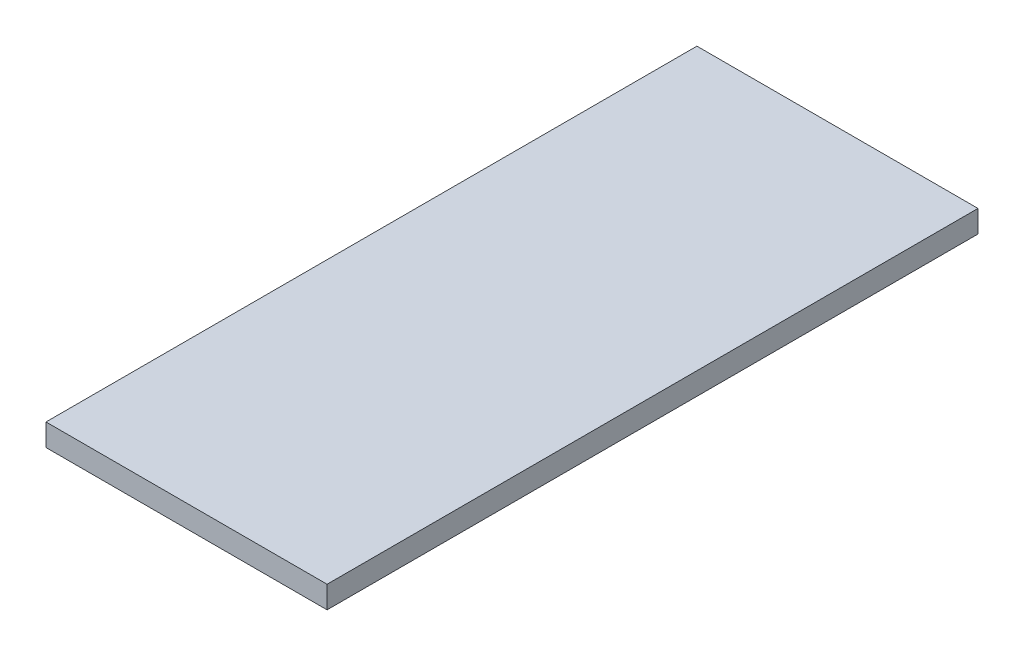
ISO-10303-21;
HEADER;
FILE_DESCRIPTION(('STEP AP214'),'2;1');
FILE_NAME('part.step','',(''),(''),'','','');
FILE_SCHEMA(('AUTOMOTIVE_DESIGN { 1 0 10303 214 1 1 1 1 }'));
ENDSEC;
DATA;
#1=APPLICATION_CONTEXT('core data for automotive mechanical design processes');
#2=APPLICATION_PROTOCOL_DEFINITION('international standard','automotive_design',2000,#1);
#3=PRODUCT_CONTEXT('',#1,'mechanical');
#4=PRODUCT('Part','Part','',(#3));
#5=PRODUCT_RELATED_PRODUCT_CATEGORY('part','',(#4));
#6=PRODUCT_DEFINITION_FORMATION('','',#4);
#7=PRODUCT_DEFINITION_CONTEXT('part definition',#1,'design');
#8=PRODUCT_DEFINITION('design','',#6,#7);
#9=PRODUCT_DEFINITION_SHAPE('','',#8);
#10=(LENGTH_UNIT() NAMED_UNIT(*) SI_UNIT(.MILLI.,.METRE.));
#11=(NAMED_UNIT(*) PLANE_ANGLE_UNIT() SI_UNIT($,.RADIAN.));
#12=(NAMED_UNIT(*) SI_UNIT($,.STERADIAN.) SOLID_ANGLE_UNIT());
#13=UNCERTAINTY_MEASURE_WITH_UNIT(LENGTH_MEASURE(1.E-05),#10,'distance_accuracy_value','');
#14=(GEOMETRIC_REPRESENTATION_CONTEXT(3) GLOBAL_UNCERTAINTY_ASSIGNED_CONTEXT((#13)) GLOBAL_UNIT_ASSIGNED_CONTEXT((#10,
#11,#12)) REPRESENTATION_CONTEXT('',''));
#15=CARTESIAN_POINT('',(0.,0.,0.));
#16=DIRECTION('',(0.,0.,1.));
#17=DIRECTION('',(1.,0.,0.));
#18=AXIS2_PLACEMENT_3D('',#15,#16,#17);
#19=CARTESIAN_POINT('',(-120.65,9.525,279.4));
#20=DIRECTION('',(1.,0.,0.));
#21=DIRECTION('',(0.,0.,-1.));
#22=AXIS2_PLACEMENT_3D('',#19,#20,#21);
#23=PLANE('',#22);
#24=DIRECTION('',(0.,0.,1.));
#25=VECTOR('',#24,1.);
#26=CARTESIAN_POINT('',(-120.65,-9.525,279.4));
#27=LINE('',#26,#25);
#28=CARTESIAN_POINT('',(-120.65,-9.525,-279.4));
#29=VERTEX_POINT('',#28);
#30=CARTESIAN_POINT('',(-120.65,-9.525,279.4));
#31=VERTEX_POINT('',#30);
#32=EDGE_CURVE('E96',#29,#31,#27,.T.);
#33=ORIENTED_EDGE('',*,*,#32,.T.);
#34=DIRECTION('',(0.,-1.,0.));
#35=VECTOR('',#34,1.);
#36=CARTESIAN_POINT('',(-120.65,9.525,279.4));
#37=LINE('',#36,#35);
#38=CARTESIAN_POINT('',(-120.65,9.525,279.4));
#39=VERTEX_POINT('',#38);
#40=EDGE_CURVE('E11',#39,#31,#37,.T.);
#41=ORIENTED_EDGE('',*,*,#40,.F.);
#42=DIRECTION('',(0.,0.,1.));
#43=VECTOR('',#42,1.);
#44=CARTESIAN_POINT('',(-120.65,9.525,279.4));
#45=LINE('',#44,#43);
#46=CARTESIAN_POINT('',(-120.65,9.525,-279.4));
#47=VERTEX_POINT('',#46);
#48=EDGE_CURVE('E84',#47,#39,#45,.T.);
#49=ORIENTED_EDGE('',*,*,#48,.F.);
#50=DIRECTION('',(0.,-1.,0.));
#51=VECTOR('',#50,1.);
#52=CARTESIAN_POINT('',(-120.65,9.525,-279.4));
#53=LINE('',#52,#51);
#54=EDGE_CURVE('E92',#47,#29,#53,.T.);
#55=ORIENTED_EDGE('',*,*,#54,.T.);
#56=EDGE_LOOP('',(#33,#41,#49,#55));
#57=FACE_BOUND('',#56,.T.);
#58=ADVANCED_FACE('F33',(#57),#23,.F.);
#59=CARTESIAN_POINT('',(120.65,9.525,279.4));
#60=DIRECTION('',(0.,0.,-1.));
#61=DIRECTION('',(-1.,0.,0.));
#62=AXIS2_PLACEMENT_3D('',#59,#60,#61);
#63=PLANE('',#62);
#64=DIRECTION('',(1.,0.,0.));
#65=VECTOR('',#64,1.);
#66=CARTESIAN_POINT('',(120.65,-9.525,279.4));
#67=LINE('',#66,#65);
#68=CARTESIAN_POINT('',(120.65,-9.525,279.4));
#69=VERTEX_POINT('',#68);
#70=EDGE_CURVE('E88',#31,#69,#67,.T.);
#71=ORIENTED_EDGE('',*,*,#70,.T.);
#72=DIRECTION('',(0.,-1.,0.));
#73=VECTOR('',#72,1.);
#74=CARTESIAN_POINT('',(120.65,9.525,279.4));
#75=LINE('',#74,#73);
#76=CARTESIAN_POINT('',(120.65,9.525,279.4));
#77=VERTEX_POINT('',#76);
#78=EDGE_CURVE('E41',#77,#69,#75,.T.);
#79=ORIENTED_EDGE('',*,*,#78,.F.);
#80=DIRECTION('',(1.,0.,0.));
#81=VECTOR('',#80,1.);
#82=CARTESIAN_POINT('',(120.65,9.525,279.4));
#83=LINE('',#82,#81);
#84=EDGE_CURVE('E79',#39,#77,#83,.T.);
#85=ORIENTED_EDGE('',*,*,#84,.F.);
#86=ORIENTED_EDGE('',*,*,#40,.T.);
#87=EDGE_LOOP('',(#71,#79,#85,#86));
#88=FACE_BOUND('',#87,.T.);
#89=ADVANCED_FACE('F87',(#88),#63,.F.);
#90=CARTESIAN_POINT('',(120.65,9.525,279.4));
#91=DIRECTION('',(-1.,0.,0.));
#92=DIRECTION('',(0.,0.,1.));
#93=AXIS2_PLACEMENT_3D('',#90,#91,#92);
#94=PLANE('',#93);
#95=DIRECTION('',(0.,0.,-1.));
#96=VECTOR('',#95,1.);
#97=CARTESIAN_POINT('',(120.65,-9.525,279.4));
#98=LINE('',#97,#96);
#99=CARTESIAN_POINT('',(120.65,-9.525,-279.4));
#100=VERTEX_POINT('',#99);
#101=EDGE_CURVE('E66',#69,#100,#98,.T.);
#102=ORIENTED_EDGE('',*,*,#101,.T.);
#103=DIRECTION('',(0.,-1.,0.));
#104=VECTOR('',#103,1.);
#105=CARTESIAN_POINT('',(120.65,9.525,-279.4));
#106=LINE('',#105,#104);
#107=CARTESIAN_POINT('',(120.65,9.525,-279.4));
#108=VERTEX_POINT('',#107);
#109=EDGE_CURVE('E89',#108,#100,#106,.T.);
#110=ORIENTED_EDGE('',*,*,#109,.F.);
#111=DIRECTION('',(0.,0.,-1.));
#112=VECTOR('',#111,1.);
#113=CARTESIAN_POINT('',(120.65,9.525,279.4));
#114=LINE('',#113,#112);
#115=EDGE_CURVE('E82',#77,#108,#114,.T.);
#116=ORIENTED_EDGE('',*,*,#115,.F.);
#117=ORIENTED_EDGE('',*,*,#78,.T.);
#118=EDGE_LOOP('',(#102,#110,#116,#117));
#119=FACE_BOUND('',#118,.T.);
#120=ADVANCED_FACE('F90',(#119),#94,.F.);
#121=CARTESIAN_POINT('',(120.65,9.525,-279.4));
#122=DIRECTION('',(0.,0.,1.));
#123=DIRECTION('',(1.,0.,0.));
#124=AXIS2_PLACEMENT_3D('',#121,#122,#123);
#125=PLANE('',#124);
#126=DIRECTION('',(-1.,0.,0.));
#127=VECTOR('',#126,1.);
#128=CARTESIAN_POINT('',(120.65,-9.525,-279.4));
#129=LINE('',#128,#127);
#130=EDGE_CURVE('E72',#100,#29,#129,.T.);
#131=ORIENTED_EDGE('',*,*,#130,.T.);
#132=ORIENTED_EDGE('',*,*,#54,.F.);
#133=DIRECTION('',(-1.,0.,0.));
#134=VECTOR('',#133,1.);
#135=CARTESIAN_POINT('',(120.65,9.525,-279.4));
#136=LINE('',#135,#134);
#137=EDGE_CURVE('E49',#108,#47,#136,.T.);
#138=ORIENTED_EDGE('',*,*,#137,.F.);
#139=ORIENTED_EDGE('',*,*,#109,.T.);
#140=EDGE_LOOP('',(#131,#132,#138,#139));
#141=FACE_BOUND('',#140,.T.);
#142=ADVANCED_FACE('F103',(#141),#125,.F.);
#143=CARTESIAN_POINT('',(0.,9.525,0.));
#144=DIRECTION('',(0.,1.,0.));
#145=DIRECTION('',(0.,0.,1.));
#146=AXIS2_PLACEMENT_3D('',#143,#144,#145);
#147=PLANE('',#146);
#148=ORIENTED_EDGE('',*,*,#48,.T.);
#149=ORIENTED_EDGE('',*,*,#84,.T.);
#150=ORIENTED_EDGE('',*,*,#115,.T.);
#151=ORIENTED_EDGE('',*,*,#137,.T.);
#152=EDGE_LOOP('',(#148,#149,#150,#151));
#153=FACE_BOUND('',#152,.T.);
#154=ADVANCED_FACE('F80',(#153),#147,.T.);
#155=CARTESIAN_POINT('',(0.,-9.525,0.));
#156=DIRECTION('',(0.,1.,0.));
#157=DIRECTION('',(0.,0.,1.));
#158=AXIS2_PLACEMENT_3D('',#155,#156,#157);
#159=PLANE('',#158);
#160=ORIENTED_EDGE('',*,*,#32,.F.);
#161=ORIENTED_EDGE('',*,*,#130,.F.);
#162=ORIENTED_EDGE('',*,*,#101,.F.);
#163=ORIENTED_EDGE('',*,*,#70,.F.);
#164=EDGE_LOOP('',(#160,#161,#162,#163));
#165=FACE_BOUND('',#164,.T.);
#166=ADVANCED_FACE('F106',(#165),#159,.F.);
#167=CLOSED_SHELL('',(#58,#89,#120,#142,#154,#166));
#168=MANIFOLD_SOLID_BREP('B2',#167);
#169=ADVANCED_BREP_SHAPE_REPRESENTATION('',(#18,#168),#14);
#170=SHAPE_DEFINITION_REPRESENTATION(#9,#169);
ENDSEC;
END-ISO-10303-21;
